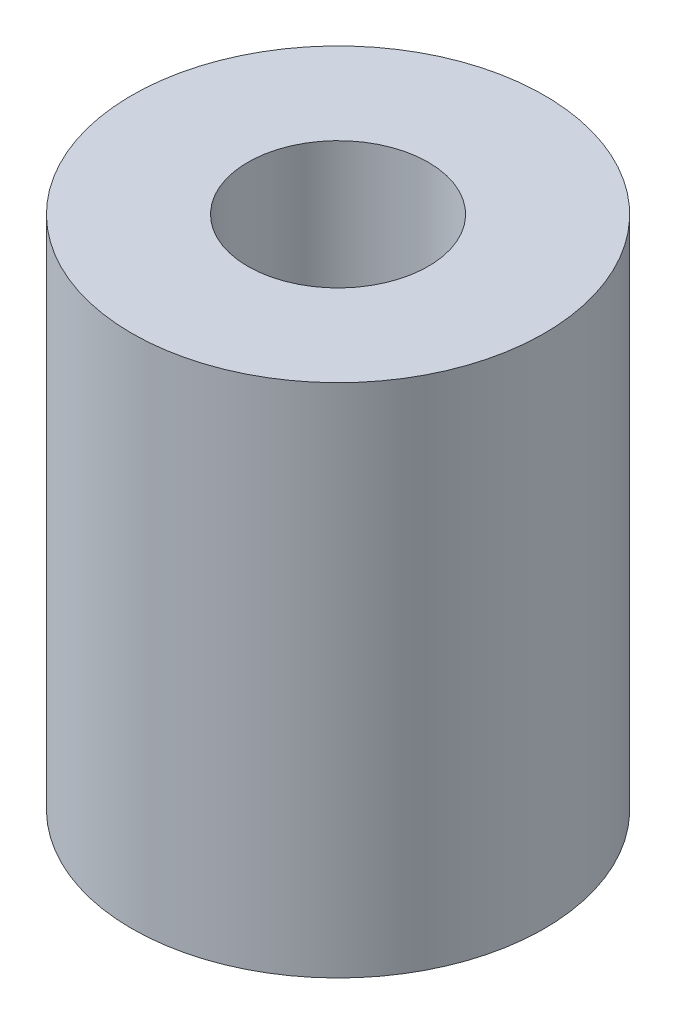
ISO-10303-21;
HEADER;
FILE_DESCRIPTION(('STEP AP214'),'2;1');
FILE_NAME('part.step','',(''),(''),'','','');
FILE_SCHEMA(('AUTOMOTIVE_DESIGN { 1 0 10303 214 1 1 1 1 }'));
ENDSEC;
DATA;
#1=APPLICATION_CONTEXT('core data for automotive mechanical design processes');
#2=APPLICATION_PROTOCOL_DEFINITION('international standard','automotive_design',2000,#1);
#3=PRODUCT_CONTEXT('',#1,'mechanical');
#4=PRODUCT('Part','Part','',(#3));
#5=PRODUCT_RELATED_PRODUCT_CATEGORY('part','',(#4));
#6=PRODUCT_DEFINITION_FORMATION('','',#4);
#7=PRODUCT_DEFINITION_CONTEXT('part definition',#1,'design');
#8=PRODUCT_DEFINITION('design','',#6,#7);
#9=PRODUCT_DEFINITION_SHAPE('','',#8);
#10=(LENGTH_UNIT() NAMED_UNIT(*) SI_UNIT(.MILLI.,.METRE.));
#11=(NAMED_UNIT(*) PLANE_ANGLE_UNIT() SI_UNIT($,.RADIAN.));
#12=(NAMED_UNIT(*) SI_UNIT($,.STERADIAN.) SOLID_ANGLE_UNIT());
#13=UNCERTAINTY_MEASURE_WITH_UNIT(LENGTH_MEASURE(1.E-05),#10,'distance_accuracy_value','');
#14=(GEOMETRIC_REPRESENTATION_CONTEXT(3) GLOBAL_UNCERTAINTY_ASSIGNED_CONTEXT((#13)) GLOBAL_UNIT_ASSIGNED_CONTEXT((#10,
#11,#12)) REPRESENTATION_CONTEXT('',''));
#15=CARTESIAN_POINT('',(0.,0.,0.));
#16=DIRECTION('',(0.,0.,1.));
#17=DIRECTION('',(1.,0.,0.));
#18=AXIS2_PLACEMENT_3D('',#15,#16,#17);
#19=CARTESIAN_POINT('',(0.,10.,0.));
#20=DIRECTION('',(0.,1.,0.));
#21=DIRECTION('',(0.,0.,1.));
#22=AXIS2_PLACEMENT_3D('',#19,#20,#21);
#23=PLANE('',#22);
#24=CARTESIAN_POINT('',(0.,10.,0.));
#25=DIRECTION('',(0.,1.,0.));
#26=DIRECTION('',(0.,0.,1.));
#27=AXIS2_PLACEMENT_3D('',#24,#25,#26);
#28=CIRCLE('',#27,4.);
#29=CARTESIAN_POINT('',(0.,10.,4.));
#30=VERTEX_POINT('',#29);
#31=EDGE_CURVE('E10',#30,#30,#28,.T.);
#32=ORIENTED_EDGE('',*,*,#31,.T.);
#33=EDGE_LOOP('',(#32));
#34=FACE_BOUND('',#33,.T.);
#35=CARTESIAN_POINT('',(0.,10.,0.));
#36=DIRECTION('',(0.,1.,0.));
#37=DIRECTION('',(0.,0.,1.));
#38=AXIS2_PLACEMENT_3D('',#35,#36,#37);
#39=CIRCLE('',#38,1.75);
#40=CARTESIAN_POINT('',(0.,10.,1.75));
#41=VERTEX_POINT('',#40);
#42=EDGE_CURVE('E44',#41,#41,#39,.T.);
#43=ORIENTED_EDGE('',*,*,#42,.F.);
#44=EDGE_LOOP('',(#43));
#45=FACE_BOUND('',#44,.T.);
#46=ADVANCED_FACE('F33',(#34,#45),#23,.T.);
#47=CARTESIAN_POINT('',(0.,0.,0.));
#48=DIRECTION('',(0.,1.,0.));
#49=DIRECTION('',(0.,0.,1.));
#50=AXIS2_PLACEMENT_3D('',#47,#48,#49);
#51=PLANE('',#50);
#52=CARTESIAN_POINT('',(0.,0.,0.));
#53=DIRECTION('',(0.,1.,0.));
#54=DIRECTION('',(0.,0.,1.));
#55=AXIS2_PLACEMENT_3D('',#52,#53,#54);
#56=CIRCLE('',#55,4.);
#57=CARTESIAN_POINT('',(0.,0.,4.));
#58=VERTEX_POINT('',#57);
#59=EDGE_CURVE('E37',#58,#58,#56,.T.);
#60=ORIENTED_EDGE('',*,*,#59,.F.);
#61=EDGE_LOOP('',(#60));
#62=FACE_BOUND('',#61,.T.);
#63=CARTESIAN_POINT('',(0.,0.,0.));
#64=DIRECTION('',(0.,1.,0.));
#65=DIRECTION('',(0.,0.,1.));
#66=AXIS2_PLACEMENT_3D('',#63,#64,#65);
#67=CIRCLE('',#66,1.75);
#68=CARTESIAN_POINT('',(0.,0.,1.75));
#69=VERTEX_POINT('',#68);
#70=EDGE_CURVE('E46',#69,#69,#67,.T.);
#71=ORIENTED_EDGE('',*,*,#70,.T.);
#72=EDGE_LOOP('',(#71));
#73=FACE_BOUND('',#72,.T.);
#74=ADVANCED_FACE('F56',(#62,#73),#51,.F.);
#75=CARTESIAN_POINT('',(0.,10.,0.));
#76=DIRECTION('',(0.,-1.,0.));
#77=DIRECTION('',(0.,0.,-1.));
#78=AXIS2_PLACEMENT_3D('',#75,#76,#77);
#79=CYLINDRICAL_SURFACE('',#78,4.);
#80=ORIENTED_EDGE('',*,*,#31,.F.);
#81=EDGE_LOOP('',(#80));
#82=FACE_BOUND('',#81,.T.);
#83=ORIENTED_EDGE('',*,*,#59,.T.);
#84=EDGE_LOOP('',(#83));
#85=FACE_BOUND('',#84,.T.);
#86=ADVANCED_FACE('F35',(#82,#85),#79,.T.);
#87=CARTESIAN_POINT('',(0.,10.,0.));
#88=DIRECTION('',(0.,-1.,0.));
#89=DIRECTION('',(0.,0.,-1.));
#90=AXIS2_PLACEMENT_3D('',#87,#88,#89);
#91=CYLINDRICAL_SURFACE('',#90,1.75);
#92=ORIENTED_EDGE('',*,*,#42,.T.);
#93=EDGE_LOOP('',(#92));
#94=FACE_BOUND('',#93,.T.);
#95=ORIENTED_EDGE('',*,*,#70,.F.);
#96=EDGE_LOOP('',(#95));
#97=FACE_BOUND('',#96,.T.);
#98=ADVANCED_FACE('F52',(#94,#97),#91,.F.);
#99=CLOSED_SHELL('',(#46,#74,#86,#98));
#100=MANIFOLD_SOLID_BREP('B2',#99);
#101=ADVANCED_BREP_SHAPE_REPRESENTATION('',(#18,#100),#14);
#102=SHAPE_DEFINITION_REPRESENTATION(#9,#101);
ENDSEC;
END-ISO-10303-21;
